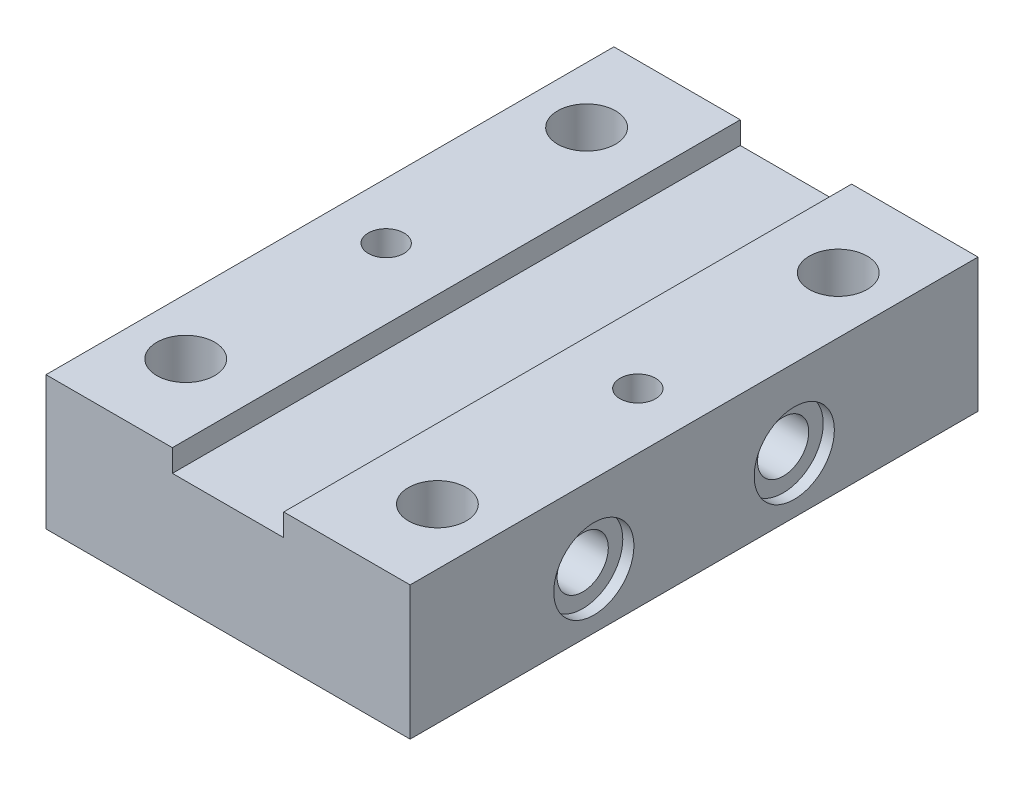
ISO-10303-21;
HEADER;
FILE_DESCRIPTION(('STEP AP214'),'2;1');
FILE_NAME('part.step','',(''),(''),'','','');
FILE_SCHEMA(('AUTOMOTIVE_DESIGN { 1 0 10303 214 1 1 1 1 }'));
ENDSEC;
DATA;
#1=APPLICATION_CONTEXT('core data for automotive mechanical design processes');
#2=APPLICATION_PROTOCOL_DEFINITION('international standard','automotive_design',2000,#1);
#3=PRODUCT_CONTEXT('',#1,'mechanical');
#4=PRODUCT('Part','Part','',(#3));
#5=PRODUCT_RELATED_PRODUCT_CATEGORY('part','',(#4));
#6=PRODUCT_DEFINITION_FORMATION('','',#4);
#7=PRODUCT_DEFINITION_CONTEXT('part definition',#1,'design');
#8=PRODUCT_DEFINITION('design','',#6,#7);
#9=PRODUCT_DEFINITION_SHAPE('','',#8);
#10=(LENGTH_UNIT() NAMED_UNIT(*) SI_UNIT(.MILLI.,.METRE.));
#11=(NAMED_UNIT(*) PLANE_ANGLE_UNIT() SI_UNIT($,.RADIAN.));
#12=(NAMED_UNIT(*) SI_UNIT($,.STERADIAN.) SOLID_ANGLE_UNIT());
#13=UNCERTAINTY_MEASURE_WITH_UNIT(LENGTH_MEASURE(1.E-05),#10,'distance_accuracy_value','');
#14=(GEOMETRIC_REPRESENTATION_CONTEXT(3) GLOBAL_UNCERTAINTY_ASSIGNED_CONTEXT((#13)) GLOBAL_UNIT_ASSIGNED_CONTEXT((#10,
#11,#12)) REPRESENTATION_CONTEXT('',''));
#15=CARTESIAN_POINT('',(0.,0.,0.));
#16=DIRECTION('',(0.,0.,1.));
#17=DIRECTION('',(1.,0.,0.));
#18=AXIS2_PLACEMENT_3D('',#15,#16,#17);
#19=CARTESIAN_POINT('',(0.,12.,0.));
#20=DIRECTION('',(0.,1.,0.));
#21=DIRECTION('',(0.,0.,1.));
#22=AXIS2_PLACEMENT_3D('',#19,#20,#21);
#23=PLANE('',#22);
#24=DIRECTION('',(0.,0.,1.));
#25=VECTOR('',#24,1.);
#26=CARTESIAN_POINT('',(-5.,12.,-25.5));
#27=LINE('',#26,#25);
#28=CARTESIAN_POINT('',(-5.,12.,-25.5));
#29=VERTEX_POINT('',#28);
#30=CARTESIAN_POINT('',(-5.,12.,25.5));
#31=VERTEX_POINT('',#30);
#32=EDGE_CURVE('E197',#29,#31,#27,.T.);
#33=ORIENTED_EDGE('',*,*,#32,.F.);
#34=DIRECTION('',(-1.,0.,0.));
#35=VECTOR('',#34,1.);
#36=CARTESIAN_POINT('',(-16.35,12.,-25.5));
#37=LINE('',#36,#35);
#38=CARTESIAN_POINT('',(-16.35,12.,-25.5));
#39=VERTEX_POINT('',#38);
#40=EDGE_CURVE('E243',#29,#39,#37,.T.);
#41=ORIENTED_EDGE('',*,*,#40,.T.);
#42=DIRECTION('',(0.,0.,1.));
#43=VECTOR('',#42,1.);
#44=CARTESIAN_POINT('',(-16.35,12.,-25.5));
#45=LINE('',#44,#43);
#46=CARTESIAN_POINT('',(-16.35,12.,25.5));
#47=VERTEX_POINT('',#46);
#48=EDGE_CURVE('E245',#39,#47,#45,.T.);
#49=ORIENTED_EDGE('',*,*,#48,.T.);
#50=DIRECTION('',(1.,0.,0.));
#51=VECTOR('',#50,1.);
#52=CARTESIAN_POINT('',(-16.35,12.,25.5));
#53=LINE('',#52,#51);
#54=EDGE_CURVE('E247',#47,#31,#53,.T.);
#55=ORIENTED_EDGE('',*,*,#54,.T.);
#56=EDGE_LOOP('',(#33,#41,#49,#55));
#57=FACE_BOUND('',#56,.T.);
#58=CARTESIAN_POINT('',(-11.3,12.,-18.));
#59=DIRECTION('',(0.,1.,0.));
#60=DIRECTION('',(0.,0.,1.));
#61=AXIS2_PLACEMENT_3D('',#58,#59,#60);
#62=CIRCLE('',#61,2.6);
#63=CARTESIAN_POINT('',(-11.3,12.,-15.4));
#64=VERTEX_POINT('',#63);
#65=EDGE_CURVE('E214',#64,#64,#62,.T.);
#66=ORIENTED_EDGE('',*,*,#65,.F.);
#67=EDGE_LOOP('',(#66));
#68=FACE_BOUND('',#67,.T.);
#69=CARTESIAN_POINT('',(-11.3,12.,0.));
#70=DIRECTION('',(0.,1.,0.));
#71=DIRECTION('',(0.,0.,-1.));
#72=AXIS2_PLACEMENT_3D('',#69,#70,#71);
#73=CIRCLE('',#72,1.6);
#74=CARTESIAN_POINT('',(-11.3,12.,-1.6));
#75=VERTEX_POINT('',#74);
#76=EDGE_CURVE('E230',#75,#75,#73,.T.);
#77=ORIENTED_EDGE('',*,*,#76,.F.);
#78=EDGE_LOOP('',(#77));
#79=FACE_BOUND('',#78,.T.);
#80=CARTESIAN_POINT('',(-11.3,12.,18.));
#81=DIRECTION('',(0.,1.,0.));
#82=DIRECTION('',(0.,0.,-1.));
#83=AXIS2_PLACEMENT_3D('',#80,#81,#82);
#84=CIRCLE('',#83,2.6);
#85=CARTESIAN_POINT('',(-11.3,12.,15.4));
#86=VERTEX_POINT('',#85);
#87=EDGE_CURVE('E224',#86,#86,#84,.T.);
#88=ORIENTED_EDGE('',*,*,#87,.F.);
#89=EDGE_LOOP('',(#88));
#90=FACE_BOUND('',#89,.T.);
#91=ADVANCED_FACE('F40',(#57,#68,#79,#90),#23,.T.);
#92=CARTESIAN_POINT('',(16.35,12.,-25.5));
#93=DIRECTION('',(-1.,0.,0.));
#94=DIRECTION('',(0.,0.,1.));
#95=AXIS2_PLACEMENT_3D('',#92,#93,#94);
#96=PLANE('',#95);
#97=CARTESIAN_POINT('',(16.35,5.,-9.));
#98=DIRECTION('',(1.,0.,0.));
#99=DIRECTION('',(0.,0.,-1.));
#100=AXIS2_PLACEMENT_3D('',#97,#98,#99);
#101=CIRCLE('',#100,3.6);
#102=CARTESIAN_POINT('',(16.35,5.,-12.6));
#103=VERTEX_POINT('',#102);
#104=EDGE_CURVE('E142',#103,#103,#101,.T.);
#105=ORIENTED_EDGE('',*,*,#104,.F.);
#106=EDGE_LOOP('',(#105));
#107=FACE_BOUND('',#106,.T.);
#108=CARTESIAN_POINT('',(16.35,4.99999999999999,9.));
#109=DIRECTION('',(1.,0.,0.));
#110=DIRECTION('',(0.,0.,-1.));
#111=AXIS2_PLACEMENT_3D('',#108,#109,#110);
#112=CIRCLE('',#111,3.6);
#113=CARTESIAN_POINT('',(16.35,4.99999999999999,5.4));
#114=VERTEX_POINT('',#113);
#115=EDGE_CURVE('E154',#114,#114,#112,.T.);
#116=ORIENTED_EDGE('',*,*,#115,.F.);
#117=EDGE_LOOP('',(#116));
#118=FACE_BOUND('',#117,.T.);
#119=DIRECTION('',(0.,0.,-1.));
#120=VECTOR('',#119,1.);
#121=CARTESIAN_POINT('',(16.35,0.,-25.5));
#122=LINE('',#121,#120);
#123=CARTESIAN_POINT('',(16.35,0.,25.5));
#124=VERTEX_POINT('',#123);
#125=CARTESIAN_POINT('',(16.35,0.,-25.5));
#126=VERTEX_POINT('',#125);
#127=EDGE_CURVE('E238',#124,#126,#122,.T.);
#128=ORIENTED_EDGE('',*,*,#127,.T.);
#129=DIRECTION('',(0.,-1.,0.));
#130=VECTOR('',#129,1.);
#131=CARTESIAN_POINT('',(16.35,12.,-25.5));
#132=LINE('',#131,#130);
#133=CARTESIAN_POINT('',(16.35,12.,-25.5));
#134=VERTEX_POINT('',#133);
#135=EDGE_CURVE('E11',#134,#126,#132,.T.);
#136=ORIENTED_EDGE('',*,*,#135,.F.);
#137=DIRECTION('',(0.,0.,-1.));
#138=VECTOR('',#137,1.);
#139=CARTESIAN_POINT('',(16.35,12.,-25.5));
#140=LINE('',#139,#138);
#141=CARTESIAN_POINT('',(16.35,12.,25.5));
#142=VERTEX_POINT('',#141);
#143=EDGE_CURVE('E241',#142,#134,#140,.T.);
#144=ORIENTED_EDGE('',*,*,#143,.F.);
#145=DIRECTION('',(0.,-1.,0.));
#146=VECTOR('',#145,1.);
#147=CARTESIAN_POINT('',(16.35,12.,25.5));
#148=LINE('',#147,#146);
#149=EDGE_CURVE('E250',#142,#124,#148,.T.);
#150=ORIENTED_EDGE('',*,*,#149,.T.);
#151=EDGE_LOOP('',(#128,#136,#144,#150));
#152=FACE_BOUND('',#151,.T.);
#153=ADVANCED_FACE('F42',(#107,#118,#152),#96,.F.);
#154=CARTESIAN_POINT('',(-16.35,12.,-25.5));
#155=DIRECTION('',(0.,0.,1.));
#156=DIRECTION('',(1.,0.,0.));
#157=AXIS2_PLACEMENT_3D('',#154,#155,#156);
#158=PLANE('',#157);
#159=ORIENTED_EDGE('',*,*,#40,.F.);
#160=DIRECTION('',(0.,-1.,0.));
#161=VECTOR('',#160,1.);
#162=CARTESIAN_POINT('',(-5.,12.,-25.5));
#163=LINE('',#162,#161);
#164=CARTESIAN_POINT('',(-5.,10.,-25.5));
#165=VERTEX_POINT('',#164);
#166=EDGE_CURVE('E182',#29,#165,#163,.T.);
#167=ORIENTED_EDGE('',*,*,#166,.T.);
#168=DIRECTION('',(1.,0.,0.));
#169=VECTOR('',#168,1.);
#170=CARTESIAN_POINT('',(-5.,10.,-25.5));
#171=LINE('',#170,#169);
#172=CARTESIAN_POINT('',(5.,10.,-25.5));
#173=VERTEX_POINT('',#172);
#174=EDGE_CURVE('E185',#165,#173,#171,.T.);
#175=ORIENTED_EDGE('',*,*,#174,.T.);
#176=DIRECTION('',(0.,1.,0.));
#177=VECTOR('',#176,1.);
#178=CARTESIAN_POINT('',(5.,12.,-25.5));
#179=LINE('',#178,#177);
#180=CARTESIAN_POINT('',(5.,12.,-25.5));
#181=VERTEX_POINT('',#180);
#182=EDGE_CURVE('E188',#173,#181,#179,.T.);
#183=ORIENTED_EDGE('',*,*,#182,.T.);
#184=EDGE_CURVE('E92',#134,#181,#37,.T.);
#185=ORIENTED_EDGE('',*,*,#184,.F.);
#186=ORIENTED_EDGE('',*,*,#135,.T.);
#187=DIRECTION('',(-1.,0.,0.));
#188=VECTOR('',#187,1.);
#189=CARTESIAN_POINT('',(-16.35,0.,-25.5));
#190=LINE('',#189,#188);
#191=CARTESIAN_POINT('',(-16.35,0.,-25.5));
#192=VERTEX_POINT('',#191);
#193=EDGE_CURVE('E253',#126,#192,#190,.T.);
#194=ORIENTED_EDGE('',*,*,#193,.T.);
#195=DIRECTION('',(0.,-1.,0.));
#196=VECTOR('',#195,1.);
#197=CARTESIAN_POINT('',(-16.35,12.,-25.5));
#198=LINE('',#197,#196);
#199=EDGE_CURVE('E48',#39,#192,#198,.T.);
#200=ORIENTED_EDGE('',*,*,#199,.F.);
#201=EDGE_LOOP('',(#159,#167,#175,#183,#185,#186,#194,#200));
#202=FACE_BOUND('',#201,.T.);
#203=ADVANCED_FACE('F287',(#202),#158,.F.);
#204=CARTESIAN_POINT('',(-16.35,12.,-25.5));
#205=DIRECTION('',(1.,0.,0.));
#206=DIRECTION('',(0.,0.,-1.));
#207=AXIS2_PLACEMENT_3D('',#204,#205,#206);
#208=PLANE('',#207);
#209=CARTESIAN_POINT('',(-16.35,5.,-9.));
#210=DIRECTION('',(-1.,0.,0.));
#211=DIRECTION('',(0.,0.,1.));
#212=AXIS2_PLACEMENT_3D('',#209,#210,#211);
#213=CIRCLE('',#212,3.6);
#214=CARTESIAN_POINT('',(-16.35,5.,-5.4));
#215=VERTEX_POINT('',#214);
#216=EDGE_CURVE('E166',#215,#215,#213,.T.);
#217=ORIENTED_EDGE('',*,*,#216,.F.);
#218=EDGE_LOOP('',(#217));
#219=FACE_BOUND('',#218,.T.);
#220=CARTESIAN_POINT('',(-16.35,4.99999999999999,9.));
#221=DIRECTION('',(-1.,0.,0.));
#222=DIRECTION('',(0.,0.,1.));
#223=AXIS2_PLACEMENT_3D('',#220,#221,#222);
#224=CIRCLE('',#223,3.6);
#225=CARTESIAN_POINT('',(-16.35,4.99999999999999,12.6));
#226=VERTEX_POINT('',#225);
#227=EDGE_CURVE('E178',#226,#226,#224,.T.);
#228=ORIENTED_EDGE('',*,*,#227,.F.);
#229=EDGE_LOOP('',(#228));
#230=FACE_BOUND('',#229,.T.);
#231=DIRECTION('',(0.,0.,1.));
#232=VECTOR('',#231,1.);
#233=CARTESIAN_POINT('',(-16.35,0.,-25.5));
#234=LINE('',#233,#232);
#235=CARTESIAN_POINT('',(-16.35,0.,25.5));
#236=VERTEX_POINT('',#235);
#237=EDGE_CURVE('E255',#192,#236,#234,.T.);
#238=ORIENTED_EDGE('',*,*,#237,.T.);
#239=DIRECTION('',(0.,-1.,0.));
#240=VECTOR('',#239,1.);
#241=CARTESIAN_POINT('',(-16.35,12.,25.5));
#242=LINE('',#241,#240);
#243=EDGE_CURVE('E259',#47,#236,#242,.T.);
#244=ORIENTED_EDGE('',*,*,#243,.F.);
#245=ORIENTED_EDGE('',*,*,#48,.F.);
#246=ORIENTED_EDGE('',*,*,#199,.T.);
#247=EDGE_LOOP('',(#238,#244,#245,#246));
#248=FACE_BOUND('',#247,.T.);
#249=ADVANCED_FACE('F265',(#219,#230,#248),#208,.F.);
#250=CARTESIAN_POINT('',(-16.35,12.,25.5));
#251=DIRECTION('',(0.,0.,-1.));
#252=DIRECTION('',(-1.,0.,0.));
#253=AXIS2_PLACEMENT_3D('',#250,#251,#252);
#254=PLANE('',#253);
#255=DIRECTION('',(1.,0.,0.));
#256=VECTOR('',#255,1.);
#257=CARTESIAN_POINT('',(-5.,10.,25.5));
#258=LINE('',#257,#256);
#259=CARTESIAN_POINT('',(-5.,10.,25.5));
#260=VERTEX_POINT('',#259);
#261=CARTESIAN_POINT('',(5.,10.,25.5));
#262=VERTEX_POINT('',#261);
#263=EDGE_CURVE('E193',#260,#262,#258,.T.);
#264=ORIENTED_EDGE('',*,*,#263,.F.);
#265=DIRECTION('',(0.,-1.,0.));
#266=VECTOR('',#265,1.);
#267=CARTESIAN_POINT('',(-5.,12.,25.5));
#268=LINE('',#267,#266);
#269=EDGE_CURVE('E181',#31,#260,#268,.T.);
#270=ORIENTED_EDGE('',*,*,#269,.F.);
#271=ORIENTED_EDGE('',*,*,#54,.F.);
#272=ORIENTED_EDGE('',*,*,#243,.T.);
#273=DIRECTION('',(1.,0.,0.));
#274=VECTOR('',#273,1.);
#275=CARTESIAN_POINT('',(-16.35,0.,25.5));
#276=LINE('',#275,#274);
#277=EDGE_CURVE('E85',#236,#124,#276,.T.);
#278=ORIENTED_EDGE('',*,*,#277,.T.);
#279=ORIENTED_EDGE('',*,*,#149,.F.);
#280=CARTESIAN_POINT('',(5.,12.,25.5));
#281=VERTEX_POINT('',#280);
#282=EDGE_CURVE('E63',#281,#142,#53,.T.);
#283=ORIENTED_EDGE('',*,*,#282,.F.);
#284=DIRECTION('',(0.,1.,0.));
#285=VECTOR('',#284,1.);
#286=CARTESIAN_POINT('',(5.,12.,25.5));
#287=LINE('',#286,#285);
#288=EDGE_CURVE('E55',#262,#281,#287,.T.);
#289=ORIENTED_EDGE('',*,*,#288,.F.);
#290=EDGE_LOOP('',(#264,#270,#271,#272,#278,#279,#283,#289));
#291=FACE_BOUND('',#290,.T.);
#292=ADVANCED_FACE('F275',(#291),#254,.F.);
#293=DIRECTION('',(0.,0.,1.));
#294=VECTOR('',#293,1.);
#295=CARTESIAN_POINT('',(5.,12.,-25.5));
#296=LINE('',#295,#294);
#297=EDGE_CURVE('E200',#181,#281,#296,.T.);
#298=ORIENTED_EDGE('',*,*,#297,.T.);
#299=ORIENTED_EDGE('',*,*,#282,.T.);
#300=ORIENTED_EDGE('',*,*,#143,.T.);
#301=ORIENTED_EDGE('',*,*,#184,.T.);
#302=EDGE_LOOP('',(#298,#299,#300,#301));
#303=FACE_BOUND('',#302,.T.);
#304=CARTESIAN_POINT('',(11.3,12.,-18.));
#305=DIRECTION('',(0.,1.,0.));
#306=DIRECTION('',(0.,0.,-1.));
#307=AXIS2_PLACEMENT_3D('',#304,#305,#306);
#308=CIRCLE('',#307,2.6);
#309=CARTESIAN_POINT('',(11.3,12.,-20.6));
#310=VERTEX_POINT('',#309);
#311=EDGE_CURVE('E211',#310,#310,#308,.T.);
#312=ORIENTED_EDGE('',*,*,#311,.F.);
#313=EDGE_LOOP('',(#312));
#314=FACE_BOUND('',#313,.T.);
#315=CARTESIAN_POINT('',(11.3,12.,18.));
#316=DIRECTION('',(0.,1.,0.));
#317=DIRECTION('',(0.,0.,1.));
#318=AXIS2_PLACEMENT_3D('',#315,#316,#317);
#319=CIRCLE('',#318,2.6);
#320=CARTESIAN_POINT('',(11.3,12.,20.6));
#321=VERTEX_POINT('',#320);
#322=EDGE_CURVE('E218',#321,#321,#319,.T.);
#323=ORIENTED_EDGE('',*,*,#322,.F.);
#324=EDGE_LOOP('',(#323));
#325=FACE_BOUND('',#324,.T.);
#326=CARTESIAN_POINT('',(11.3,12.,0.));
#327=DIRECTION('',(0.,1.,0.));
#328=DIRECTION('',(0.,0.,1.));
#329=AXIS2_PLACEMENT_3D('',#326,#327,#328);
#330=CIRCLE('',#329,1.6);
#331=CARTESIAN_POINT('',(11.3,12.,1.6));
#332=VERTEX_POINT('',#331);
#333=EDGE_CURVE('E205',#332,#332,#330,.T.);
#334=ORIENTED_EDGE('',*,*,#333,.F.);
#335=EDGE_LOOP('',(#334));
#336=FACE_BOUND('',#335,.T.);
#337=ADVANCED_FACE('F288',(#303,#314,#325,#336),#23,.T.);
#338=CARTESIAN_POINT('',(0.,0.,0.));
#339=DIRECTION('',(0.,1.,0.));
#340=DIRECTION('',(0.,0.,1.));
#341=AXIS2_PLACEMENT_3D('',#338,#339,#340);
#342=PLANE('',#341);
#343=CARTESIAN_POINT('',(11.3,0.,-18.));
#344=DIRECTION('',(0.,1.,0.));
#345=DIRECTION('',(0.,0.,-1.));
#346=AXIS2_PLACEMENT_3D('',#343,#344,#345);
#347=CIRCLE('',#346,2.6);
#348=CARTESIAN_POINT('',(11.3,0.,-20.6));
#349=VERTEX_POINT('',#348);
#350=EDGE_CURVE('E215',#349,#349,#347,.T.);
#351=ORIENTED_EDGE('',*,*,#350,.T.);
#352=EDGE_LOOP('',(#351));
#353=FACE_BOUND('',#352,.T.);
#354=CARTESIAN_POINT('',(11.3,0.,18.));
#355=DIRECTION('',(0.,1.,0.));
#356=DIRECTION('',(0.,0.,1.));
#357=AXIS2_PLACEMENT_3D('',#354,#355,#356);
#358=CIRCLE('',#357,2.6);
#359=CARTESIAN_POINT('',(11.3,0.,20.6));
#360=VERTEX_POINT('',#359);
#361=EDGE_CURVE('E221',#360,#360,#358,.T.);
#362=ORIENTED_EDGE('',*,*,#361,.T.);
#363=EDGE_LOOP('',(#362));
#364=FACE_BOUND('',#363,.T.);
#365=CARTESIAN_POINT('',(-11.3,0.,18.));
#366=DIRECTION('',(0.,1.,0.));
#367=DIRECTION('',(0.,0.,-1.));
#368=AXIS2_PLACEMENT_3D('',#365,#366,#367);
#369=CIRCLE('',#368,2.6);
#370=CARTESIAN_POINT('',(-11.3,0.,15.4));
#371=VERTEX_POINT('',#370);
#372=EDGE_CURVE('E227',#371,#371,#369,.T.);
#373=ORIENTED_EDGE('',*,*,#372,.T.);
#374=EDGE_LOOP('',(#373));
#375=FACE_BOUND('',#374,.T.);
#376=CARTESIAN_POINT('',(-11.3,0.,0.));
#377=DIRECTION('',(0.,1.,0.));
#378=DIRECTION('',(0.,0.,-1.));
#379=AXIS2_PLACEMENT_3D('',#376,#377,#378);
#380=CIRCLE('',#379,1.6);
#381=CARTESIAN_POINT('',(-11.3,0.,-1.6));
#382=VERTEX_POINT('',#381);
#383=EDGE_CURVE('E208',#382,#382,#380,.T.);
#384=ORIENTED_EDGE('',*,*,#383,.T.);
#385=EDGE_LOOP('',(#384));
#386=FACE_BOUND('',#385,.T.);
#387=CARTESIAN_POINT('',(11.3,0.,0.));
#388=DIRECTION('',(0.,1.,0.));
#389=DIRECTION('',(0.,0.,1.));
#390=AXIS2_PLACEMENT_3D('',#387,#388,#389);
#391=CIRCLE('',#390,1.6);
#392=CARTESIAN_POINT('',(11.3,0.,1.6));
#393=VERTEX_POINT('',#392);
#394=EDGE_CURVE('E199',#393,#393,#391,.T.);
#395=ORIENTED_EDGE('',*,*,#394,.T.);
#396=EDGE_LOOP('',(#395));
#397=FACE_BOUND('',#396,.T.);
#398=CARTESIAN_POINT('',(-11.3,0.,-18.));
#399=DIRECTION('',(0.,1.,0.));
#400=DIRECTION('',(0.,0.,1.));
#401=AXIS2_PLACEMENT_3D('',#398,#399,#400);
#402=CIRCLE('',#401,2.6);
#403=CARTESIAN_POINT('',(-11.3,0.,-15.4));
#404=VERTEX_POINT('',#403);
#405=EDGE_CURVE('E235',#404,#404,#402,.T.);
#406=ORIENTED_EDGE('',*,*,#405,.T.);
#407=EDGE_LOOP('',(#406));
#408=FACE_BOUND('',#407,.T.);
#409=ORIENTED_EDGE('',*,*,#127,.F.);
#410=ORIENTED_EDGE('',*,*,#277,.F.);
#411=ORIENTED_EDGE('',*,*,#237,.F.);
#412=ORIENTED_EDGE('',*,*,#193,.F.);
#413=EDGE_LOOP('',(#409,#410,#411,#412));
#414=FACE_BOUND('',#413,.T.);
#415=ADVANCED_FACE('F270',(#353,#364,#375,#386,#397,#408,#414),#342,.F.);
#416=CARTESIAN_POINT('',(-11.3,0.,-18.));
#417=DIRECTION('',(0.,1.,0.));
#418=DIRECTION('',(0.,0.,1.));
#419=AXIS2_PLACEMENT_3D('',#416,#417,#418);
#420=CYLINDRICAL_SURFACE('',#419,2.6);
#421=ORIENTED_EDGE('',*,*,#405,.F.);
#422=EDGE_LOOP('',(#421));
#423=FACE_BOUND('',#422,.T.);
#424=ORIENTED_EDGE('',*,*,#65,.T.);
#425=EDGE_LOOP('',(#424));
#426=FACE_BOUND('',#425,.T.);
#427=ADVANCED_FACE('F317',(#423,#426),#420,.F.);
#428=CARTESIAN_POINT('',(11.3,0.,0.));
#429=DIRECTION('',(0.,1.,0.));
#430=DIRECTION('',(0.,0.,1.));
#431=AXIS2_PLACEMENT_3D('',#428,#429,#430);
#432=CYLINDRICAL_SURFACE('',#431,1.6);
#433=ORIENTED_EDGE('',*,*,#394,.F.);
#434=EDGE_LOOP('',(#433));
#435=FACE_BOUND('',#434,.T.);
#436=ORIENTED_EDGE('',*,*,#333,.T.);
#437=EDGE_LOOP('',(#436));
#438=FACE_BOUND('',#437,.T.);
#439=ADVANCED_FACE('F362',(#435,#438),#432,.F.);
#440=CARTESIAN_POINT('',(-11.3,0.,0.));
#441=DIRECTION('',(0.,1.,0.));
#442=DIRECTION('',(0.,0.,1.));
#443=AXIS2_PLACEMENT_3D('',#440,#441,#442);
#444=CYLINDRICAL_SURFACE('',#443,1.6);
#445=ORIENTED_EDGE('',*,*,#383,.F.);
#446=EDGE_LOOP('',(#445));
#447=FACE_BOUND('',#446,.T.);
#448=ORIENTED_EDGE('',*,*,#76,.T.);
#449=EDGE_LOOP('',(#448));
#450=FACE_BOUND('',#449,.T.);
#451=ADVANCED_FACE('F371',(#447,#450),#444,.F.);
#452=CARTESIAN_POINT('',(-11.3,0.,18.));
#453=DIRECTION('',(0.,1.,0.));
#454=DIRECTION('',(0.,0.,1.));
#455=AXIS2_PLACEMENT_3D('',#452,#453,#454);
#456=CYLINDRICAL_SURFACE('',#455,2.6);
#457=ORIENTED_EDGE('',*,*,#372,.F.);
#458=EDGE_LOOP('',(#457));
#459=FACE_BOUND('',#458,.T.);
#460=ORIENTED_EDGE('',*,*,#87,.T.);
#461=EDGE_LOOP('',(#460));
#462=FACE_BOUND('',#461,.T.);
#463=ADVANCED_FACE('F381',(#459,#462),#456,.F.);
#464=CARTESIAN_POINT('',(11.3,0.,18.));
#465=DIRECTION('',(0.,1.,0.));
#466=DIRECTION('',(0.,0.,1.));
#467=AXIS2_PLACEMENT_3D('',#464,#465,#466);
#468=CYLINDRICAL_SURFACE('',#467,2.6);
#469=ORIENTED_EDGE('',*,*,#361,.F.);
#470=EDGE_LOOP('',(#469));
#471=FACE_BOUND('',#470,.T.);
#472=ORIENTED_EDGE('',*,*,#322,.T.);
#473=EDGE_LOOP('',(#472));
#474=FACE_BOUND('',#473,.T.);
#475=ADVANCED_FACE('F391',(#471,#474),#468,.F.);
#476=CARTESIAN_POINT('',(11.3,0.,-18.));
#477=DIRECTION('',(0.,1.,0.));
#478=DIRECTION('',(0.,0.,1.));
#479=AXIS2_PLACEMENT_3D('',#476,#477,#478);
#480=CYLINDRICAL_SURFACE('',#479,2.6);
#481=ORIENTED_EDGE('',*,*,#350,.F.);
#482=EDGE_LOOP('',(#481));
#483=FACE_BOUND('',#482,.T.);
#484=ORIENTED_EDGE('',*,*,#311,.T.);
#485=EDGE_LOOP('',(#484));
#486=FACE_BOUND('',#485,.T.);
#487=ADVANCED_FACE('F299',(#483,#486),#480,.F.);
#488=CARTESIAN_POINT('',(-5.,12.,-25.5));
#489=DIRECTION('',(-1.,0.,0.));
#490=DIRECTION('',(0.,-1.,0.));
#491=AXIS2_PLACEMENT_3D('',#488,#489,#490);
#492=PLANE('',#491);
#493=ORIENTED_EDGE('',*,*,#269,.T.);
#494=DIRECTION('',(0.,0.,1.));
#495=VECTOR('',#494,1.);
#496=CARTESIAN_POINT('',(-5.,10.,-25.5));
#497=LINE('',#496,#495);
#498=EDGE_CURVE('E190',#165,#260,#497,.T.);
#499=ORIENTED_EDGE('',*,*,#498,.F.);
#500=ORIENTED_EDGE('',*,*,#166,.F.);
#501=ORIENTED_EDGE('',*,*,#32,.T.);
#502=EDGE_LOOP('',(#493,#499,#500,#501));
#503=FACE_BOUND('',#502,.T.);
#504=ADVANCED_FACE('F283',(#503),#492,.F.);
#505=CARTESIAN_POINT('',(5.,12.,-25.5));
#506=DIRECTION('',(1.,0.,0.));
#507=DIRECTION('',(0.,1.,0.));
#508=AXIS2_PLACEMENT_3D('',#505,#506,#507);
#509=PLANE('',#508);
#510=ORIENTED_EDGE('',*,*,#288,.T.);
#511=ORIENTED_EDGE('',*,*,#297,.F.);
#512=ORIENTED_EDGE('',*,*,#182,.F.);
#513=DIRECTION('',(0.,0.,1.));
#514=VECTOR('',#513,1.);
#515=CARTESIAN_POINT('',(5.,10.,-25.5));
#516=LINE('',#515,#514);
#517=EDGE_CURVE('E202',#173,#262,#516,.T.);
#518=ORIENTED_EDGE('',*,*,#517,.T.);
#519=EDGE_LOOP('',(#510,#511,#512,#518));
#520=FACE_BOUND('',#519,.T.);
#521=ADVANCED_FACE('F290',(#520),#509,.F.);
#522=CARTESIAN_POINT('',(-5.,10.,-25.5));
#523=DIRECTION('',(0.,-1.,0.));
#524=DIRECTION('',(1.,0.,0.));
#525=AXIS2_PLACEMENT_3D('',#522,#523,#524);
#526=PLANE('',#525);
#527=ORIENTED_EDGE('',*,*,#263,.T.);
#528=ORIENTED_EDGE('',*,*,#517,.F.);
#529=ORIENTED_EDGE('',*,*,#174,.F.);
#530=ORIENTED_EDGE('',*,*,#498,.T.);
#531=EDGE_LOOP('',(#527,#528,#529,#530));
#532=FACE_BOUND('',#531,.T.);
#533=ADVANCED_FACE('F279',(#532),#526,.F.);
#534=CARTESIAN_POINT('',(-16.35,4.99999999999999,9.));
#535=DIRECTION('',(-1.,0.,0.));
#536=DIRECTION('',(0.,0.,1.));
#537=AXIS2_PLACEMENT_3D('',#534,#535,#536);
#538=CYLINDRICAL_SURFACE('',#537,3.6);
#539=CARTESIAN_POINT('',(-15.35,4.99999999999999,9.));
#540=DIRECTION('',(-1.,0.,0.));
#541=DIRECTION('',(0.,0.,1.));
#542=AXIS2_PLACEMENT_3D('',#539,#540,#541);
#543=CIRCLE('',#542,3.6);
#544=CARTESIAN_POINT('',(-15.35,4.99999999999999,12.6));
#545=VERTEX_POINT('',#544);
#546=EDGE_CURVE('E175',#545,#545,#543,.T.);
#547=ORIENTED_EDGE('',*,*,#546,.F.);
#548=EDGE_LOOP('',(#547));
#549=FACE_BOUND('',#548,.T.);
#550=ORIENTED_EDGE('',*,*,#227,.T.);
#551=EDGE_LOOP('',(#550));
#552=FACE_BOUND('',#551,.T.);
#553=ADVANCED_FACE('F297',(#549,#552),#538,.F.);
#554=CARTESIAN_POINT('',(-15.35,8.59999999999999,9.));
#555=DIRECTION('',(1.,0.,0.));
#556=DIRECTION('',(0.,0.,-1.));
#557=AXIS2_PLACEMENT_3D('',#554,#555,#556);
#558=PLANE('',#557);
#559=CARTESIAN_POINT('',(-15.35,4.99999999999999,9.));
#560=DIRECTION('',(-1.,0.,0.));
#561=DIRECTION('',(0.,0.,1.));
#562=AXIS2_PLACEMENT_3D('',#559,#560,#561);
#563=CIRCLE('',#562,2.3);
#564=CARTESIAN_POINT('',(-15.35,4.99999999999999,11.3));
#565=VERTEX_POINT('',#564);
#566=EDGE_CURVE('E172',#565,#565,#563,.T.);
#567=ORIENTED_EDGE('',*,*,#566,.F.);
#568=EDGE_LOOP('',(#567));
#569=FACE_BOUND('',#568,.T.);
#570=ORIENTED_EDGE('',*,*,#546,.T.);
#571=EDGE_LOOP('',(#570));
#572=FACE_BOUND('',#571,.T.);
#573=ADVANCED_FACE('F437',(#569,#572),#558,.F.);
#574=CARTESIAN_POINT('',(-16.35,4.99999999999999,9.));
#575=DIRECTION('',(-1.,0.,0.));
#576=DIRECTION('',(0.,0.,1.));
#577=AXIS2_PLACEMENT_3D('',#574,#575,#576);
#578=CYLINDRICAL_SURFACE('',#577,2.3);
#579=CARTESIAN_POINT('',(-5.35,4.99999999999999,9.));
#580=DIRECTION('',(-1.,0.,0.));
#581=DIRECTION('',(0.,0.,1.));
#582=AXIS2_PLACEMENT_3D('',#579,#580,#581);
#583=CIRCLE('',#582,2.3);
#584=CARTESIAN_POINT('',(-5.35,4.99999999999999,11.3));
#585=VERTEX_POINT('',#584);
#586=EDGE_CURVE('E169',#585,#585,#583,.T.);
#587=ORIENTED_EDGE('',*,*,#586,.F.);
#588=EDGE_LOOP('',(#587));
#589=FACE_BOUND('',#588,.T.);
#590=ORIENTED_EDGE('',*,*,#566,.T.);
#591=EDGE_LOOP('',(#590));
#592=FACE_BOUND('',#591,.T.);
#593=ADVANCED_FACE('F446',(#589,#592),#578,.F.);
#594=CARTESIAN_POINT('',(-5.35,4.99999999999999,9.));
#595=DIRECTION('',(-1.,0.,0.));
#596=DIRECTION('',(0.,0.,1.));
#597=AXIS2_PLACEMENT_3D('',#594,#595,#596);
#598=CONICAL_SURFACE('',#597,2.3,1.02974426);
#599=CARTESIAN_POINT('',(-3.96802058037919,4.99999999999999,9.));
#600=VERTEX_POINT('',#599);
#601=VERTEX_LOOP('',#600);
#602=FACE_BOUND('',#601,.T.);
#603=ORIENTED_EDGE('',*,*,#586,.T.);
#604=EDGE_LOOP('',(#603));
#605=FACE_BOUND('',#604,.T.);
#606=ADVANCED_FACE('F456',(#602,#605),#598,.F.);
#607=CARTESIAN_POINT('',(-16.35,5.,-9.));
#608=DIRECTION('',(-1.,0.,0.));
#609=DIRECTION('',(0.,0.,1.));
#610=AXIS2_PLACEMENT_3D('',#607,#608,#609);
#611=CYLINDRICAL_SURFACE('',#610,3.6);
#612=CARTESIAN_POINT('',(-15.35,5.,-9.));
#613=DIRECTION('',(-1.,0.,0.));
#614=DIRECTION('',(0.,0.,1.));
#615=AXIS2_PLACEMENT_3D('',#612,#613,#614);
#616=CIRCLE('',#615,3.6);
#617=CARTESIAN_POINT('',(-15.35,5.,-5.4));
#618=VERTEX_POINT('',#617);
#619=EDGE_CURVE('E163',#618,#618,#616,.T.);
#620=ORIENTED_EDGE('',*,*,#619,.F.);
#621=EDGE_LOOP('',(#620));
#622=FACE_BOUND('',#621,.T.);
#623=ORIENTED_EDGE('',*,*,#216,.T.);
#624=EDGE_LOOP('',(#623));
#625=FACE_BOUND('',#624,.T.);
#626=ADVANCED_FACE('F466',(#622,#625),#611,.F.);
#627=CARTESIAN_POINT('',(-15.35,8.6,-9.));
#628=DIRECTION('',(1.,0.,0.));
#629=DIRECTION('',(0.,0.,-1.));
#630=AXIS2_PLACEMENT_3D('',#627,#628,#629);
#631=PLANE('',#630);
#632=CARTESIAN_POINT('',(-15.35,5.,-9.));
#633=DIRECTION('',(-1.,0.,0.));
#634=DIRECTION('',(0.,0.,1.));
#635=AXIS2_PLACEMENT_3D('',#632,#633,#634);
#636=CIRCLE('',#635,2.3);
#637=CARTESIAN_POINT('',(-15.35,5.,-6.7));
#638=VERTEX_POINT('',#637);
#639=EDGE_CURVE('E160',#638,#638,#636,.T.);
#640=ORIENTED_EDGE('',*,*,#639,.F.);
#641=EDGE_LOOP('',(#640));
#642=FACE_BOUND('',#641,.T.);
#643=ORIENTED_EDGE('',*,*,#619,.T.);
#644=EDGE_LOOP('',(#643));
#645=FACE_BOUND('',#644,.T.);
#646=ADVANCED_FACE('F476',(#642,#645),#631,.F.);
#647=CARTESIAN_POINT('',(-16.35,5.,-9.));
#648=DIRECTION('',(-1.,0.,0.));
#649=DIRECTION('',(0.,0.,1.));
#650=AXIS2_PLACEMENT_3D('',#647,#648,#649);
#651=CYLINDRICAL_SURFACE('',#650,2.3);
#652=CARTESIAN_POINT('',(-5.35000000000001,5.,-9.));
#653=DIRECTION('',(-1.,0.,0.));
#654=DIRECTION('',(0.,0.,1.));
#655=AXIS2_PLACEMENT_3D('',#652,#653,#654);
#656=CIRCLE('',#655,2.3);
#657=CARTESIAN_POINT('',(-5.35000000000001,5.,-6.7));
#658=VERTEX_POINT('',#657);
#659=EDGE_CURVE('E157',#658,#658,#656,.T.);
#660=ORIENTED_EDGE('',*,*,#659,.F.);
#661=EDGE_LOOP('',(#660));
#662=FACE_BOUND('',#661,.T.);
#663=ORIENTED_EDGE('',*,*,#639,.T.);
#664=EDGE_LOOP('',(#663));
#665=FACE_BOUND('',#664,.T.);
#666=ADVANCED_FACE('F486',(#662,#665),#651,.F.);
#667=CARTESIAN_POINT('',(-5.35000000000001,5.,-9.));
#668=DIRECTION('',(-1.,0.,0.));
#669=DIRECTION('',(0.,0.,1.));
#670=AXIS2_PLACEMENT_3D('',#667,#668,#669);
#671=CONICAL_SURFACE('',#670,2.3,1.02974426);
#672=CARTESIAN_POINT('',(-3.9680205803792,5.,-9.));
#673=VERTEX_POINT('',#672);
#674=VERTEX_LOOP('',#673);
#675=FACE_BOUND('',#674,.T.);
#676=ORIENTED_EDGE('',*,*,#659,.T.);
#677=EDGE_LOOP('',(#676));
#678=FACE_BOUND('',#677,.T.);
#679=ADVANCED_FACE('F496',(#675,#678),#671,.F.);
#680=CARTESIAN_POINT('',(16.35,4.99999999999999,9.));
#681=DIRECTION('',(1.,0.,0.));
#682=DIRECTION('',(0.,0.,-1.));
#683=AXIS2_PLACEMENT_3D('',#680,#681,#682);
#684=CYLINDRICAL_SURFACE('',#683,3.6);
#685=CARTESIAN_POINT('',(15.35,4.99999999999999,9.));
#686=DIRECTION('',(1.,0.,0.));
#687=DIRECTION('',(0.,0.,-1.));
#688=AXIS2_PLACEMENT_3D('',#685,#686,#687);
#689=CIRCLE('',#688,3.6);
#690=CARTESIAN_POINT('',(15.35,4.99999999999999,5.4));
#691=VERTEX_POINT('',#690);
#692=EDGE_CURVE('E151',#691,#691,#689,.T.);
#693=ORIENTED_EDGE('',*,*,#692,.F.);
#694=EDGE_LOOP('',(#693));
#695=FACE_BOUND('',#694,.T.);
#696=ORIENTED_EDGE('',*,*,#115,.T.);
#697=EDGE_LOOP('',(#696));
#698=FACE_BOUND('',#697,.T.);
#699=ADVANCED_FACE('F506',(#695,#698),#684,.F.);
#700=CARTESIAN_POINT('',(15.35,8.59999999999999,9.));
#701=DIRECTION('',(-1.,0.,0.));
#702=DIRECTION('',(0.,0.,1.));
#703=AXIS2_PLACEMENT_3D('',#700,#701,#702);
#704=PLANE('',#703);
#705=CARTESIAN_POINT('',(15.35,4.99999999999999,9.));
#706=DIRECTION('',(1.,0.,0.));
#707=DIRECTION('',(0.,0.,-1.));
#708=AXIS2_PLACEMENT_3D('',#705,#706,#707);
#709=CIRCLE('',#708,2.3);
#710=CARTESIAN_POINT('',(15.35,4.99999999999999,6.7));
#711=VERTEX_POINT('',#710);
#712=EDGE_CURVE('E148',#711,#711,#709,.T.);
#713=ORIENTED_EDGE('',*,*,#712,.F.);
#714=EDGE_LOOP('',(#713));
#715=FACE_BOUND('',#714,.T.);
#716=ORIENTED_EDGE('',*,*,#692,.T.);
#717=EDGE_LOOP('',(#716));
#718=FACE_BOUND('',#717,.T.);
#719=ADVANCED_FACE('F516',(#715,#718),#704,.F.);
#720=CARTESIAN_POINT('',(16.35,4.99999999999999,9.));
#721=DIRECTION('',(1.,0.,0.));
#722=DIRECTION('',(0.,0.,-1.));
#723=AXIS2_PLACEMENT_3D('',#720,#721,#722);
#724=CYLINDRICAL_SURFACE('',#723,2.3);
#725=CARTESIAN_POINT('',(5.35,4.99999999999999,9.));
#726=DIRECTION('',(1.,0.,0.));
#727=DIRECTION('',(0.,0.,-1.));
#728=AXIS2_PLACEMENT_3D('',#725,#726,#727);
#729=CIRCLE('',#728,2.3);
#730=CARTESIAN_POINT('',(5.35,4.99999999999999,6.7));
#731=VERTEX_POINT('',#730);
#732=EDGE_CURVE('E145',#731,#731,#729,.T.);
#733=ORIENTED_EDGE('',*,*,#732,.F.);
#734=EDGE_LOOP('',(#733));
#735=FACE_BOUND('',#734,.T.);
#736=ORIENTED_EDGE('',*,*,#712,.T.);
#737=EDGE_LOOP('',(#736));
#738=FACE_BOUND('',#737,.T.);
#739=ADVANCED_FACE('F526',(#735,#738),#724,.F.);
#740=CARTESIAN_POINT('',(5.35,4.99999999999999,9.));
#741=DIRECTION('',(1.,0.,0.));
#742=DIRECTION('',(0.,0.,-1.));
#743=AXIS2_PLACEMENT_3D('',#740,#741,#742);
#744=CONICAL_SURFACE('',#743,2.3,1.02974426);
#745=CARTESIAN_POINT('',(3.96802058037919,4.99999999999999,9.));
#746=VERTEX_POINT('',#745);
#747=VERTEX_LOOP('',#746);
#748=FACE_BOUND('',#747,.T.);
#749=ORIENTED_EDGE('',*,*,#732,.T.);
#750=EDGE_LOOP('',(#749));
#751=FACE_BOUND('',#750,.T.);
#752=ADVANCED_FACE('F536',(#748,#751),#744,.F.);
#753=CARTESIAN_POINT('',(16.35,5.,-9.));
#754=DIRECTION('',(1.,0.,0.));
#755=DIRECTION('',(0.,0.,-1.));
#756=AXIS2_PLACEMENT_3D('',#753,#754,#755);
#757=CYLINDRICAL_SURFACE('',#756,3.6);
#758=CARTESIAN_POINT('',(15.35,5.,-9.));
#759=DIRECTION('',(1.,0.,0.));
#760=DIRECTION('',(0.,0.,-1.));
#761=AXIS2_PLACEMENT_3D('',#758,#759,#760);
#762=CIRCLE('',#761,3.6);
#763=CARTESIAN_POINT('',(15.35,5.,-12.6));
#764=VERTEX_POINT('',#763);
#765=EDGE_CURVE('E137',#764,#764,#762,.T.);
#766=ORIENTED_EDGE('',*,*,#765,.F.);
#767=EDGE_LOOP('',(#766));
#768=FACE_BOUND('',#767,.T.);
#769=ORIENTED_EDGE('',*,*,#104,.T.);
#770=EDGE_LOOP('',(#769));
#771=FACE_BOUND('',#770,.T.);
#772=ADVANCED_FACE('F546',(#768,#771),#757,.F.);
#773=CARTESIAN_POINT('',(15.35,8.6,-9.));
#774=DIRECTION('',(-1.,0.,0.));
#775=DIRECTION('',(0.,0.,1.));
#776=AXIS2_PLACEMENT_3D('',#773,#774,#775);
#777=PLANE('',#776);
#778=CARTESIAN_POINT('',(15.35,5.,-9.));
#779=DIRECTION('',(1.,0.,0.));
#780=DIRECTION('',(0.,0.,-1.));
#781=AXIS2_PLACEMENT_3D('',#778,#779,#780);
#782=CIRCLE('',#781,2.3);
#783=CARTESIAN_POINT('',(15.35,5.,-11.3));
#784=VERTEX_POINT('',#783);
#785=EDGE_CURVE('E134',#784,#784,#782,.T.);
#786=ORIENTED_EDGE('',*,*,#785,.F.);
#787=EDGE_LOOP('',(#786));
#788=FACE_BOUND('',#787,.T.);
#789=ORIENTED_EDGE('',*,*,#765,.T.);
#790=EDGE_LOOP('',(#789));
#791=FACE_BOUND('',#790,.T.);
#792=ADVANCED_FACE('F556',(#788,#791),#777,.F.);
#793=CARTESIAN_POINT('',(16.35,5.,-9.));
#794=DIRECTION('',(1.,0.,0.));
#795=DIRECTION('',(0.,0.,-1.));
#796=AXIS2_PLACEMENT_3D('',#793,#794,#795);
#797=CYLINDRICAL_SURFACE('',#796,2.3);
#798=CARTESIAN_POINT('',(5.35000000000001,5.,-9.));
#799=DIRECTION('',(1.,0.,0.));
#800=DIRECTION('',(0.,0.,-1.));
#801=AXIS2_PLACEMENT_3D('',#798,#799,#800);
#802=CIRCLE('',#801,2.3);
#803=CARTESIAN_POINT('',(5.35000000000001,5.,-11.3));
#804=VERTEX_POINT('',#803);
#805=EDGE_CURVE('E132',#804,#804,#802,.T.);
#806=ORIENTED_EDGE('',*,*,#805,.F.);
#807=EDGE_LOOP('',(#806));
#808=FACE_BOUND('',#807,.T.);
#809=ORIENTED_EDGE('',*,*,#785,.T.);
#810=EDGE_LOOP('',(#809));
#811=FACE_BOUND('',#810,.T.);
#812=ADVANCED_FACE('F128',(#808,#811),#797,.F.);
#813=CARTESIAN_POINT('',(5.35000000000001,5.,-9.));
#814=DIRECTION('',(1.,0.,0.));
#815=DIRECTION('',(0.,0.,-1.));
#816=AXIS2_PLACEMENT_3D('',#813,#814,#815);
#817=CONICAL_SURFACE('',#816,2.3,1.02974426);
#818=CARTESIAN_POINT('',(3.9680205803792,5.,-9.));
#819=VERTEX_POINT('',#818);
#820=VERTEX_LOOP('',#819);
#821=FACE_BOUND('',#820,.T.);
#822=ORIENTED_EDGE('',*,*,#805,.T.);
#823=EDGE_LOOP('',(#822));
#824=FACE_BOUND('',#823,.T.);
#825=ADVANCED_FACE('F125',(#821,#824),#817,.F.);
#826=CLOSED_SHELL('',(#91,#153,#203,#249,#292,#337,#415,#427,#439,#451,#463,#475,#487,#504,#521,
#533,#553,#573,#593,#606,#626,#646,#666,#679,#699,#719,#739,#752,#772,#792,#812,#825));
#827=MANIFOLD_SOLID_BREP('B2',#826);
#828=ADVANCED_BREP_SHAPE_REPRESENTATION('',(#18,#827),#14);
#829=SHAPE_DEFINITION_REPRESENTATION(#9,#828);
ENDSEC;
END-ISO-10303-21;
